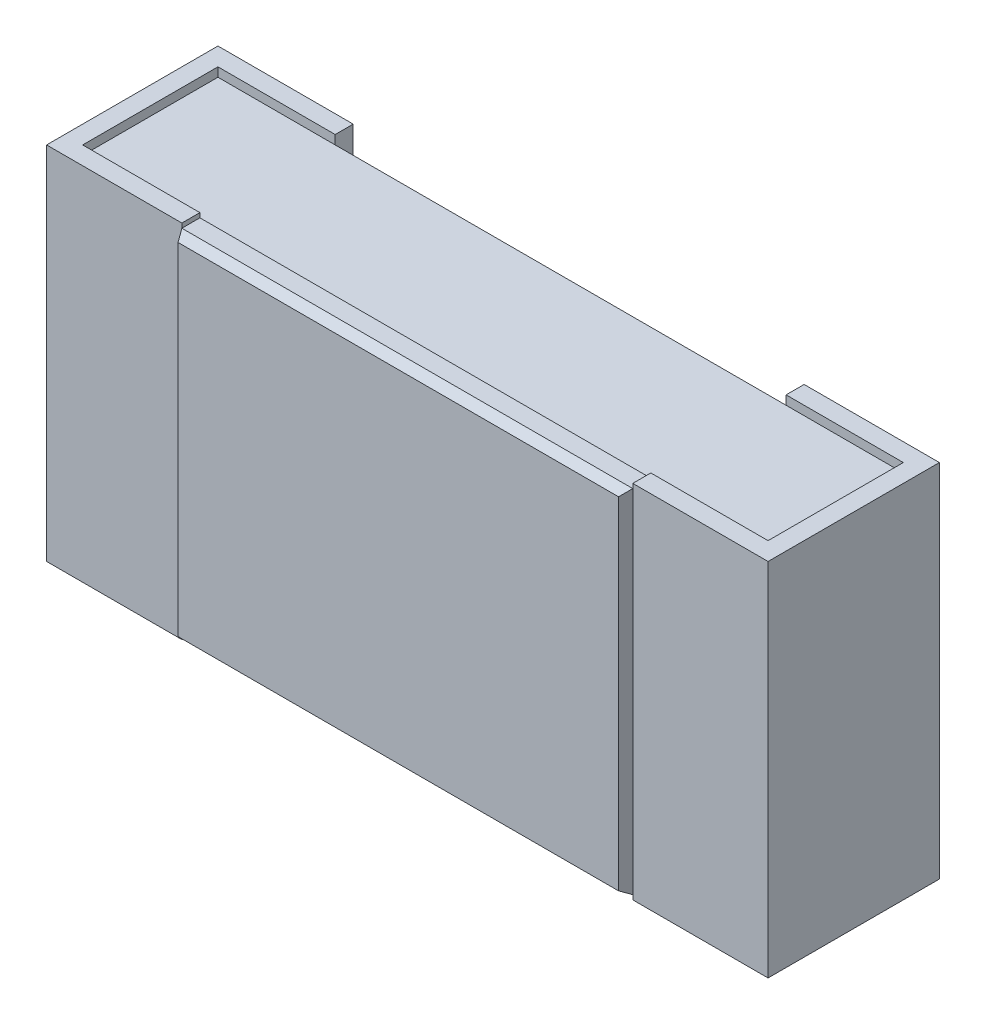
ISO-10303-21;
HEADER;
FILE_DESCRIPTION(('STEP AP214'),'2;1');
FILE_NAME('part.step','',(''),(''),'','','');
FILE_SCHEMA(('AUTOMOTIVE_DESIGN { 1 0 10303 214 1 1 1 1 }'));
ENDSEC;
DATA;
#1=APPLICATION_CONTEXT('core data for automotive mechanical design processes');
#2=APPLICATION_PROTOCOL_DEFINITION('international standard','automotive_design',2000,#1);
#3=PRODUCT_CONTEXT('',#1,'mechanical');
#4=PRODUCT('Part','Part','',(#3));
#5=PRODUCT_RELATED_PRODUCT_CATEGORY('part','',(#4));
#6=PRODUCT_DEFINITION_FORMATION('','',#4);
#7=PRODUCT_DEFINITION_CONTEXT('part definition',#1,'design');
#8=PRODUCT_DEFINITION('design','',#6,#7);
#9=PRODUCT_DEFINITION_SHAPE('','',#8);
#10=(LENGTH_UNIT() NAMED_UNIT(*) SI_UNIT(.MILLI.,.METRE.));
#11=(NAMED_UNIT(*) PLANE_ANGLE_UNIT() SI_UNIT($,.RADIAN.));
#12=(NAMED_UNIT(*) SI_UNIT($,.STERADIAN.) SOLID_ANGLE_UNIT());
#13=UNCERTAINTY_MEASURE_WITH_UNIT(LENGTH_MEASURE(1.E-05),#10,'distance_accuracy_value','');
#14=(GEOMETRIC_REPRESENTATION_CONTEXT(3) GLOBAL_UNCERTAINTY_ASSIGNED_CONTEXT((#13)) GLOBAL_UNIT_ASSIGNED_CONTEXT((#10,
#11,#12)) REPRESENTATION_CONTEXT('',''));
#15=CARTESIAN_POINT('',(0.,0.,0.));
#16=DIRECTION('',(0.,0.,1.));
#17=DIRECTION('',(1.,0.,0.));
#18=AXIS2_PLACEMENT_3D('',#15,#16,#17);
#19=CARTESIAN_POINT('',(0.5,-0.39,0.4));
#20=DIRECTION('',(0.,0.,1.));
#21=DIRECTION('',(1.,0.,0.));
#22=AXIS2_PLACEMENT_3D('',#19,#20,#21);
#23=PLANE('',#22);
#24=DIRECTION('',(0.,1.,0.));
#25=VECTOR('',#24,1.);
#26=CARTESIAN_POINT('',(-0.488452994616151,0.39,0.400000000000087));
#27=LINE('',#26,#25);
#28=CARTESIAN_POINT('',(-0.488452994616038,-0.378452994616038,0.400000000000044));
#29=VERTEX_POINT('',#28);
#30=CARTESIAN_POINT('',(-0.488452994616076,0.378452994616038,0.400000000000066));
#31=VERTEX_POINT('',#30);
#32=EDGE_CURVE('E20',#29,#31,#27,.T.);
#33=ORIENTED_EDGE('',*,*,#32,.F.);
#34=DIRECTION('',(1.,0.,0.));
#35=VECTOR('',#34,1.);
#36=CARTESIAN_POINT('',(-0.5,-0.378452994616151,0.400000000000087));
#37=LINE('',#36,#35);
#38=CARTESIAN_POINT('',(0.488452994616038,-0.378452994616038,0.400000000000044));
#39=VERTEX_POINT('',#38);
#40=EDGE_CURVE('E203',#39,#29,#37,.F.);
#41=ORIENTED_EDGE('',*,*,#40,.F.);
#42=DIRECTION('',(0.,1.,0.));
#43=VECTOR('',#42,1.);
#44=CARTESIAN_POINT('',(0.488452994616151,0.39,0.400000000000087));
#45=LINE('',#44,#43);
#46=CARTESIAN_POINT('',(0.488452994616038,0.378452994616038,0.400000000000044));
#47=VERTEX_POINT('',#46);
#48=EDGE_CURVE('E198',#47,#39,#45,.F.);
#49=ORIENTED_EDGE('',*,*,#48,.F.);
#50=DIRECTION('',(1.,0.,0.));
#51=VECTOR('',#50,1.);
#52=CARTESIAN_POINT('',(-0.5,0.378452994616151,0.400000000000087));
#53=LINE('',#52,#51);
#54=EDGE_CURVE('E213',#31,#47,#53,.T.);
#55=ORIENTED_EDGE('',*,*,#54,.F.);
#56=EDGE_LOOP('',(#33,#41,#49,#55));
#57=FACE_BOUND('',#56,.T.);
#58=ADVANCED_FACE('F17',(#57),#23,.T.);
#59=CARTESIAN_POINT('',(-0.5,0.39,0.38));
#60=DIRECTION('',(-0.866025403784329,0.,0.50000000000019));
#61=DIRECTION('',(0.50000000000019,0.,0.866025403784329));
#62=AXIS2_PLACEMENT_3D('',#59,#60,#61);
#63=PLANE('',#62);
#64=ORIENTED_EDGE('',*,*,#32,.T.);
#65=DIRECTION('',(0.447213595504779,-0.447213595498923,0.774596669239298));
#66=VECTOR('',#65,1.);
#67=CARTESIAN_POINT('',(-0.5,0.39,0.38));
#68=LINE('',#67,#66);
#69=CARTESIAN_POINT('',(-0.5,0.39,0.38));
#70=VERTEX_POINT('',#69);
#71=EDGE_CURVE('E225',#70,#31,#68,.T.);
#72=ORIENTED_EDGE('',*,*,#71,.F.);
#73=DIRECTION('',(0.,1.,0.));
#74=VECTOR('',#73,1.);
#75=CARTESIAN_POINT('',(-0.5,-0.4,0.38));
#76=LINE('',#75,#74);
#77=CARTESIAN_POINT('',(-0.5,-0.39,0.38));
#78=VERTEX_POINT('',#77);
#79=EDGE_CURVE('E219',#78,#70,#76,.T.);
#80=ORIENTED_EDGE('',*,*,#79,.F.);
#81=DIRECTION('',(-0.447213595504779,-0.447213595498923,-0.774596669239298));
#82=VECTOR('',#81,1.);
#83=CARTESIAN_POINT('',(-0.488452994616,-0.378452994616151,0.400000000000087));
#84=LINE('',#83,#82);
#85=EDGE_CURVE('E208',#29,#78,#84,.T.);
#86=ORIENTED_EDGE('',*,*,#85,.F.);
#87=EDGE_LOOP('',(#64,#72,#80,#86));
#88=FACE_BOUND('',#87,.T.);
#89=ADVANCED_FACE('F218',(#88),#63,.T.);
#90=CARTESIAN_POINT('',(-0.5,-0.39,0.38));
#91=DIRECTION('',(0.,-0.866025403784329,0.50000000000019));
#92=DIRECTION('',(0.,-0.50000000000019,-0.866025403784329));
#93=AXIS2_PLACEMENT_3D('',#90,#91,#92);
#94=PLANE('',#93);
#95=ORIENTED_EDGE('',*,*,#40,.T.);
#96=ORIENTED_EDGE('',*,*,#85,.T.);
#97=DIRECTION('',(1.,0.,0.));
#98=VECTOR('',#97,1.);
#99=CARTESIAN_POINT('',(-0.5,-0.39,0.38));
#100=LINE('',#99,#98);
#101=CARTESIAN_POINT('',(0.5,-0.39,0.38));
#102=VERTEX_POINT('',#101);
#103=EDGE_CURVE('E233',#102,#78,#100,.F.);
#104=ORIENTED_EDGE('',*,*,#103,.F.);
#105=DIRECTION('',(0.44721359549892,-0.447213595504782,-0.774596669239297));
#106=VECTOR('',#105,1.);
#107=CARTESIAN_POINT('',(0.488452994616151,-0.378452994616,0.400000000000087));
#108=LINE('',#107,#106);
#109=EDGE_CURVE('E210',#39,#102,#108,.T.);
#110=ORIENTED_EDGE('',*,*,#109,.F.);
#111=EDGE_LOOP('',(#95,#96,#104,#110));
#112=FACE_BOUND('',#111,.T.);
#113=ADVANCED_FACE('F205',(#112),#94,.T.);
#114=CARTESIAN_POINT('',(0.5,0.39,0.38));
#115=DIRECTION('',(0.866025403784329,0.,0.50000000000019));
#116=DIRECTION('',(0.50000000000019,0.,-0.866025403784329));
#117=AXIS2_PLACEMENT_3D('',#114,#115,#116);
#118=PLANE('',#117);
#119=ORIENTED_EDGE('',*,*,#48,.T.);
#120=ORIENTED_EDGE('',*,*,#109,.T.);
#121=DIRECTION('',(0.,1.,0.));
#122=VECTOR('',#121,1.);
#123=CARTESIAN_POINT('',(0.5,-0.4,0.38));
#124=LINE('',#123,#122);
#125=CARTESIAN_POINT('',(0.5,0.39,0.38));
#126=VERTEX_POINT('',#125);
#127=EDGE_CURVE('E244',#126,#102,#124,.F.);
#128=ORIENTED_EDGE('',*,*,#127,.F.);
#129=DIRECTION('',(0.447213595504775,0.447213595498924,-0.774596669239299));
#130=VECTOR('',#129,1.);
#131=CARTESIAN_POINT('',(0.488452994616,0.378452994616151,0.400000000000087));
#132=LINE('',#131,#130);
#133=EDGE_CURVE('E228',#47,#126,#132,.T.);
#134=ORIENTED_EDGE('',*,*,#133,.F.);
#135=EDGE_LOOP('',(#119,#120,#128,#134));
#136=FACE_BOUND('',#135,.T.);
#137=ADVANCED_FACE('F581',(#136),#118,.T.);
#138=CARTESIAN_POINT('',(-0.5,0.39,0.38));
#139=DIRECTION('',(0.,0.866025403784329,0.50000000000019));
#140=DIRECTION('',(0.,-0.50000000000019,0.866025403784329));
#141=AXIS2_PLACEMENT_3D('',#138,#139,#140);
#142=PLANE('',#141);
#143=ORIENTED_EDGE('',*,*,#54,.T.);
#144=ORIENTED_EDGE('',*,*,#133,.T.);
#145=DIRECTION('',(1.,0.,0.));
#146=VECTOR('',#145,1.);
#147=CARTESIAN_POINT('',(-0.5,0.39,0.38));
#148=LINE('',#147,#146);
#149=EDGE_CURVE('E252',#70,#126,#148,.T.);
#150=ORIENTED_EDGE('',*,*,#149,.F.);
#151=ORIENTED_EDGE('',*,*,#71,.T.);
#152=EDGE_LOOP('',(#143,#144,#150,#151));
#153=FACE_BOUND('',#152,.T.);
#154=ADVANCED_FACE('F577',(#153),#142,.T.);
#155=CARTESIAN_POINT('',(-0.8,-0.4,0.38));
#156=DIRECTION('',(0.,0.,1.));
#157=DIRECTION('',(1.,0.,0.));
#158=AXIS2_PLACEMENT_3D('',#155,#156,#157);
#159=PLANE('',#158);
#160=DIRECTION('',(0.,1.,0.));
#161=VECTOR('',#160,1.);
#162=CARTESIAN_POINT('',(-0.8,-0.4,0.38));
#163=LINE('',#162,#161);
#164=CARTESIAN_POINT('',(-0.8,-0.4,0.38));
#165=VERTEX_POINT('',#164);
#166=CARTESIAN_POINT('',(-0.8,0.4,0.38));
#167=VERTEX_POINT('',#166);
#168=EDGE_CURVE('E231',#165,#167,#163,.T.);
#169=ORIENTED_EDGE('',*,*,#168,.F.);
#170=DIRECTION('',(1.,0.,0.));
#171=VECTOR('',#170,1.);
#172=CARTESIAN_POINT('',(-0.8,-0.4,0.38));
#173=LINE('',#172,#171);
#174=CARTESIAN_POINT('',(-0.5,-0.4,0.38));
#175=VERTEX_POINT('',#174);
#176=EDGE_CURVE('E275',#165,#175,#173,.T.);
#177=ORIENTED_EDGE('',*,*,#176,.T.);
#178=DIRECTION('',(0.,1.,0.));
#179=VECTOR('',#178,1.);
#180=CARTESIAN_POINT('',(-0.5,-0.4,0.38));
#181=LINE('',#180,#179);
#182=EDGE_CURVE('E238',#78,#175,#181,.F.);
#183=ORIENTED_EDGE('',*,*,#182,.F.);
#184=ORIENTED_EDGE('',*,*,#79,.T.);
#185=DIRECTION('',(0.,1.,0.));
#186=VECTOR('',#185,1.);
#187=CARTESIAN_POINT('',(-0.5,-0.4,0.38));
#188=LINE('',#187,#186);
#189=CARTESIAN_POINT('',(-0.5,0.4,0.38));
#190=VERTEX_POINT('',#189);
#191=EDGE_CURVE('E249',#190,#70,#188,.F.);
#192=ORIENTED_EDGE('',*,*,#191,.F.);
#193=DIRECTION('',(1.,0.,0.));
#194=VECTOR('',#193,1.);
#195=CARTESIAN_POINT('',(-0.8,0.4,0.38));
#196=LINE('',#195,#194);
#197=EDGE_CURVE('E268',#167,#190,#196,.T.);
#198=ORIENTED_EDGE('',*,*,#197,.F.);
#199=EDGE_LOOP('',(#169,#177,#183,#184,#192,#198));
#200=FACE_BOUND('',#199,.T.);
#201=ADVANCED_FACE('F573',(#200),#159,.T.);
#202=CARTESIAN_POINT('',(-0.8,-0.4,0.));
#203=DIRECTION('',(-1.,0.,0.));
#204=DIRECTION('',(0.,0.,1.));
#205=AXIS2_PLACEMENT_3D('',#202,#203,#204);
#206=PLANE('',#205);
#207=DIRECTION('',(0.,1.,0.));
#208=VECTOR('',#207,1.);
#209=CARTESIAN_POINT('',(-0.8,-0.4,0.));
#210=LINE('',#209,#208);
#211=CARTESIAN_POINT('',(-0.8,-0.4,0.));
#212=VERTEX_POINT('',#211);
#213=CARTESIAN_POINT('',(-0.8,0.4,0.));
#214=VERTEX_POINT('',#213);
#215=EDGE_CURVE('E263',#212,#214,#210,.T.);
#216=ORIENTED_EDGE('',*,*,#215,.F.);
#217=DIRECTION('',(0.,0.,1.));
#218=VECTOR('',#217,1.);
#219=CARTESIAN_POINT('',(-0.8,-0.4,0.38));
#220=LINE('',#219,#218);
#221=EDGE_CURVE('E284',#212,#165,#220,.T.);
#222=ORIENTED_EDGE('',*,*,#221,.T.);
#223=ORIENTED_EDGE('',*,*,#168,.T.);
#224=DIRECTION('',(0.,0.,1.));
#225=VECTOR('',#224,1.);
#226=CARTESIAN_POINT('',(-0.8,0.4,0.38));
#227=LINE('',#226,#225);
#228=EDGE_CURVE('E265',#214,#167,#227,.T.);
#229=ORIENTED_EDGE('',*,*,#228,.F.);
#230=EDGE_LOOP('',(#216,#222,#223,#229));
#231=FACE_BOUND('',#230,.T.);
#232=ADVANCED_FACE('F569',(#231),#206,.T.);
#233=CARTESIAN_POINT('',(-0.5,-0.39,0.34));
#234=DIRECTION('',(0.,-1.,0.));
#235=DIRECTION('',(0.,0.,-1.));
#236=AXIS2_PLACEMENT_3D('',#233,#234,#235);
#237=PLANE('',#236);
#238=DIRECTION('',(-1.,0.,0.));
#239=VECTOR('',#238,1.);
#240=CARTESIAN_POINT('',(-0.5,-0.39,0.34));
#241=LINE('',#240,#239);
#242=CARTESIAN_POINT('',(0.5,-0.39,0.34));
#243=VERTEX_POINT('',#242);
#244=CARTESIAN_POINT('',(-0.5,-0.39,0.34));
#245=VERTEX_POINT('',#244);
#246=EDGE_CURVE('E292',#243,#245,#241,.T.);
#247=ORIENTED_EDGE('',*,*,#246,.F.);
#248=DIRECTION('',(0.,0.,1.));
#249=VECTOR('',#248,1.);
#250=CARTESIAN_POINT('',(0.5,-0.39,0.38));
#251=LINE('',#250,#249);
#252=EDGE_CURVE('E240',#102,#243,#251,.F.);
#253=ORIENTED_EDGE('',*,*,#252,.F.);
#254=ORIENTED_EDGE('',*,*,#103,.T.);
#255=DIRECTION('',(0.,0.,-1.));
#256=VECTOR('',#255,1.);
#257=CARTESIAN_POINT('',(-0.5,-0.39,0.38));
#258=LINE('',#257,#256);
#259=EDGE_CURVE('E235',#245,#78,#258,.F.);
#260=ORIENTED_EDGE('',*,*,#259,.F.);
#261=EDGE_LOOP('',(#247,#253,#254,#260));
#262=FACE_BOUND('',#261,.T.);
#263=ADVANCED_FACE('F565',(#262),#237,.T.);
#264=CARTESIAN_POINT('',(-0.5,-0.4,0.38));
#265=DIRECTION('',(1.,0.,0.));
#266=DIRECTION('',(0.,0.,-1.));
#267=AXIS2_PLACEMENT_3D('',#264,#265,#266);
#268=PLANE('',#267);
#269=DIRECTION('',(0.,0.,1.));
#270=VECTOR('',#269,1.);
#271=CARTESIAN_POINT('',(-0.5,-0.4,0.38));
#272=LINE('',#271,#270);
#273=CARTESIAN_POINT('',(-0.5,-0.4,0.34));
#274=VERTEX_POINT('',#273);
#275=EDGE_CURVE('E278',#175,#274,#272,.F.);
#276=ORIENTED_EDGE('',*,*,#275,.T.);
#277=DIRECTION('',(0.,1.,0.));
#278=VECTOR('',#277,1.);
#279=CARTESIAN_POINT('',(-0.5,-0.4,0.34));
#280=LINE('',#279,#278);
#281=EDGE_CURVE('E294',#245,#274,#280,.F.);
#282=ORIENTED_EDGE('',*,*,#281,.F.);
#283=ORIENTED_EDGE('',*,*,#259,.T.);
#284=ORIENTED_EDGE('',*,*,#182,.T.);
#285=EDGE_LOOP('',(#276,#282,#283,#284));
#286=FACE_BOUND('',#285,.T.);
#287=ADVANCED_FACE('F561',(#286),#268,.T.);
#288=CARTESIAN_POINT('',(0.5,-0.4,0.38));
#289=DIRECTION('',(-1.,0.,0.));
#290=DIRECTION('',(0.,0.,1.));
#291=AXIS2_PLACEMENT_3D('',#288,#289,#290);
#292=PLANE('',#291);
#293=DIRECTION('',(0.,0.,-1.));
#294=VECTOR('',#293,1.);
#295=CARTESIAN_POINT('',(0.5,-0.4,0.34));
#296=LINE('',#295,#294);
#297=CARTESIAN_POINT('',(0.5,-0.4,0.38));
#298=VERTEX_POINT('',#297);
#299=CARTESIAN_POINT('',(0.5,-0.4,0.34));
#300=VERTEX_POINT('',#299);
#301=EDGE_CURVE('E323',#298,#300,#296,.T.);
#302=ORIENTED_EDGE('',*,*,#301,.F.);
#303=DIRECTION('',(0.,1.,0.));
#304=VECTOR('',#303,1.);
#305=CARTESIAN_POINT('',(0.5,-0.4,0.38));
#306=LINE('',#305,#304);
#307=EDGE_CURVE('E247',#102,#298,#306,.F.);
#308=ORIENTED_EDGE('',*,*,#307,.F.);
#309=ORIENTED_EDGE('',*,*,#252,.T.);
#310=DIRECTION('',(0.,1.,0.));
#311=VECTOR('',#310,1.);
#312=CARTESIAN_POINT('',(0.5,-0.4,0.339999999999999));
#313=LINE('',#312,#311);
#314=EDGE_CURVE('E289',#300,#243,#313,.T.);
#315=ORIENTED_EDGE('',*,*,#314,.F.);
#316=EDGE_LOOP('',(#302,#308,#309,#315));
#317=FACE_BOUND('',#316,.T.);
#318=ADVANCED_FACE('F557',(#317),#292,.T.);
#319=CARTESIAN_POINT('',(0.8,-0.4,0.));
#320=DIRECTION('',(1.,0.,0.));
#321=DIRECTION('',(0.,0.,-1.));
#322=AXIS2_PLACEMENT_3D('',#319,#320,#321);
#323=PLANE('',#322);
#324=DIRECTION('',(0.,1.,0.));
#325=VECTOR('',#324,1.);
#326=CARTESIAN_POINT('',(0.8,-0.4,0.38));
#327=LINE('',#326,#325);
#328=CARTESIAN_POINT('',(0.8,-0.4,0.38));
#329=VERTEX_POINT('',#328);
#330=CARTESIAN_POINT('',(0.8,0.4,0.38));
#331=VERTEX_POINT('',#330);
#332=EDGE_CURVE('E242',#329,#331,#327,.T.);
#333=ORIENTED_EDGE('',*,*,#332,.F.);
#334=DIRECTION('',(0.,0.,-1.));
#335=VECTOR('',#334,1.);
#336=CARTESIAN_POINT('',(0.8,-0.4,0.34));
#337=LINE('',#336,#335);
#338=CARTESIAN_POINT('',(0.8,-0.4,0.));
#339=VERTEX_POINT('',#338);
#340=EDGE_CURVE('E334',#339,#329,#337,.F.);
#341=ORIENTED_EDGE('',*,*,#340,.F.);
#342=DIRECTION('',(0.,1.,0.));
#343=VECTOR('',#342,1.);
#344=CARTESIAN_POINT('',(0.8,-0.4,0.));
#345=LINE('',#344,#343);
#346=CARTESIAN_POINT('',(0.8,0.4,0.));
#347=VERTEX_POINT('',#346);
#348=EDGE_CURVE('E321',#347,#339,#345,.F.);
#349=ORIENTED_EDGE('',*,*,#348,.F.);
#350=DIRECTION('',(0.,0.,-1.));
#351=VECTOR('',#350,1.);
#352=CARTESIAN_POINT('',(0.8,0.4,0.34));
#353=LINE('',#352,#351);
#354=EDGE_CURVE('E309',#347,#331,#353,.F.);
#355=ORIENTED_EDGE('',*,*,#354,.T.);
#356=EDGE_LOOP('',(#333,#341,#349,#355));
#357=FACE_BOUND('',#356,.T.);
#358=ADVANCED_FACE('F553',(#357),#323,.T.);
#359=CARTESIAN_POINT('',(0.8,-0.4,0.38));
#360=DIRECTION('',(0.,0.,1.));
#361=DIRECTION('',(1.,0.,0.));
#362=AXIS2_PLACEMENT_3D('',#359,#360,#361);
#363=PLANE('',#362);
#364=ORIENTED_EDGE('',*,*,#307,.T.);
#365=DIRECTION('',(1.,0.,0.));
#366=VECTOR('',#365,1.);
#367=CARTESIAN_POINT('',(0.5,-0.4,0.38));
#368=LINE('',#367,#366);
#369=EDGE_CURVE('E336',#329,#298,#368,.F.);
#370=ORIENTED_EDGE('',*,*,#369,.F.);
#371=ORIENTED_EDGE('',*,*,#332,.T.);
#372=DIRECTION('',(1.,0.,0.));
#373=VECTOR('',#372,1.);
#374=CARTESIAN_POINT('',(0.5,0.4,0.38));
#375=LINE('',#374,#373);
#376=CARTESIAN_POINT('',(0.5,0.4,0.38));
#377=VERTEX_POINT('',#376);
#378=EDGE_CURVE('E312',#331,#377,#375,.F.);
#379=ORIENTED_EDGE('',*,*,#378,.T.);
#380=DIRECTION('',(0.,1.,0.));
#381=VECTOR('',#380,1.);
#382=CARTESIAN_POINT('',(0.5,-0.4,0.38));
#383=LINE('',#382,#381);
#384=EDGE_CURVE('E261',#126,#377,#383,.T.);
#385=ORIENTED_EDGE('',*,*,#384,.F.);
#386=ORIENTED_EDGE('',*,*,#127,.T.);
#387=EDGE_LOOP('',(#364,#370,#371,#379,#385,#386));
#388=FACE_BOUND('',#387,.T.);
#389=ADVANCED_FACE('F549',(#388),#363,.T.);
#390=CARTESIAN_POINT('',(-0.5,-0.4,0.38));
#391=DIRECTION('',(1.,0.,0.));
#392=DIRECTION('',(0.,0.,-1.));
#393=AXIS2_PLACEMENT_3D('',#390,#391,#392);
#394=PLANE('',#393);
#395=DIRECTION('',(0.,0.,1.));
#396=VECTOR('',#395,1.);
#397=CARTESIAN_POINT('',(-0.5,0.4,0.38));
#398=LINE('',#397,#396);
#399=CARTESIAN_POINT('',(-0.5,0.4,0.34));
#400=VERTEX_POINT('',#399);
#401=EDGE_CURVE('E270',#190,#400,#398,.F.);
#402=ORIENTED_EDGE('',*,*,#401,.F.);
#403=ORIENTED_EDGE('',*,*,#191,.T.);
#404=DIRECTION('',(0.,0.,1.));
#405=VECTOR('',#404,1.);
#406=CARTESIAN_POINT('',(-0.5,0.39,0.34));
#407=LINE('',#406,#405);
#408=CARTESIAN_POINT('',(-0.5,0.39,0.34));
#409=VERTEX_POINT('',#408);
#410=EDGE_CURVE('E255',#409,#70,#407,.T.);
#411=ORIENTED_EDGE('',*,*,#410,.F.);
#412=DIRECTION('',(0.,1.,0.));
#413=VECTOR('',#412,1.);
#414=CARTESIAN_POINT('',(-0.5,-0.4,0.34));
#415=LINE('',#414,#413);
#416=EDGE_CURVE('E344',#400,#409,#415,.F.);
#417=ORIENTED_EDGE('',*,*,#416,.F.);
#418=EDGE_LOOP('',(#402,#403,#411,#417));
#419=FACE_BOUND('',#418,.T.);
#420=ADVANCED_FACE('F545',(#419),#394,.T.);
#421=CARTESIAN_POINT('',(-0.5,0.39,0.34));
#422=DIRECTION('',(0.,1.,0.));
#423=DIRECTION('',(0.,0.,1.));
#424=AXIS2_PLACEMENT_3D('',#421,#422,#423);
#425=PLANE('',#424);
#426=DIRECTION('',(-1.,0.,0.));
#427=VECTOR('',#426,1.);
#428=CARTESIAN_POINT('',(-0.5,0.39,0.34));
#429=LINE('',#428,#427);
#430=CARTESIAN_POINT('',(0.5,0.39,0.34));
#431=VERTEX_POINT('',#430);
#432=EDGE_CURVE('E346',#409,#431,#429,.F.);
#433=ORIENTED_EDGE('',*,*,#432,.F.);
#434=ORIENTED_EDGE('',*,*,#410,.T.);
#435=ORIENTED_EDGE('',*,*,#149,.T.);
#436=DIRECTION('',(0.,0.,1.));
#437=VECTOR('',#436,1.);
#438=CARTESIAN_POINT('',(0.5,0.39,0.38));
#439=LINE('',#438,#437);
#440=EDGE_CURVE('E258',#431,#126,#439,.T.);
#441=ORIENTED_EDGE('',*,*,#440,.F.);
#442=EDGE_LOOP('',(#433,#434,#435,#441));
#443=FACE_BOUND('',#442,.T.);
#444=ADVANCED_FACE('F541',(#443),#425,.T.);
#445=CARTESIAN_POINT('',(0.5,-0.4,0.38));
#446=DIRECTION('',(-1.,0.,0.));
#447=DIRECTION('',(0.,0.,1.));
#448=AXIS2_PLACEMENT_3D('',#445,#446,#447);
#449=PLANE('',#448);
#450=DIRECTION('',(0.,0.,-1.));
#451=VECTOR('',#450,1.);
#452=CARTESIAN_POINT('',(0.5,0.4,0.34));
#453=LINE('',#452,#451);
#454=CARTESIAN_POINT('',(0.5,0.4,0.34));
#455=VERTEX_POINT('',#454);
#456=EDGE_CURVE('E315',#377,#455,#453,.T.);
#457=ORIENTED_EDGE('',*,*,#456,.T.);
#458=DIRECTION('',(0.,1.,0.));
#459=VECTOR('',#458,1.);
#460=CARTESIAN_POINT('',(0.5,-0.4,0.339999999999999));
#461=LINE('',#460,#459);
#462=EDGE_CURVE('E348',#431,#455,#461,.T.);
#463=ORIENTED_EDGE('',*,*,#462,.F.);
#464=ORIENTED_EDGE('',*,*,#440,.T.);
#465=ORIENTED_EDGE('',*,*,#384,.T.);
#466=EDGE_LOOP('',(#457,#463,#464,#465));
#467=FACE_BOUND('',#466,.T.);
#468=ADVANCED_FACE('F538',(#467),#449,.T.);
#469=CARTESIAN_POINT('',(-0.8,-0.4,0.));
#470=DIRECTION('',(0.,0.,-1.));
#471=DIRECTION('',(-1.,0.,0.));
#472=AXIS2_PLACEMENT_3D('',#469,#470,#471);
#473=PLANE('',#472);
#474=DIRECTION('',(0.,1.,0.));
#475=VECTOR('',#474,1.);
#476=CARTESIAN_POINT('',(-0.5,-0.4,0.));
#477=LINE('',#476,#475);
#478=CARTESIAN_POINT('',(-0.5,-0.4,0.));
#479=VERTEX_POINT('',#478);
#480=CARTESIAN_POINT('',(-0.5,0.4,0.));
#481=VERTEX_POINT('',#480);
#482=EDGE_CURVE('E367',#479,#481,#477,.T.);
#483=ORIENTED_EDGE('',*,*,#482,.F.);
#484=DIRECTION('',(1.,0.,0.));
#485=VECTOR('',#484,1.);
#486=CARTESIAN_POINT('',(-0.8,-0.4,0.));
#487=LINE('',#486,#485);
#488=EDGE_CURVE('E281',#479,#212,#487,.F.);
#489=ORIENTED_EDGE('',*,*,#488,.T.);
#490=ORIENTED_EDGE('',*,*,#215,.T.);
#491=DIRECTION('',(1.,0.,0.));
#492=VECTOR('',#491,1.);
#493=CARTESIAN_POINT('',(-0.8,0.4,0.));
#494=LINE('',#493,#492);
#495=EDGE_CURVE('E272',#481,#214,#494,.F.);
#496=ORIENTED_EDGE('',*,*,#495,.F.);
#497=EDGE_LOOP('',(#483,#489,#490,#496));
#498=FACE_BOUND('',#497,.T.);
#499=ADVANCED_FACE('F455',(#498),#473,.T.);
#500=CARTESIAN_POINT('',(-0.8,0.4,0.38));
#501=DIRECTION('',(0.,1.,0.));
#502=DIRECTION('',(0.,0.,1.));
#503=AXIS2_PLACEMENT_3D('',#500,#501,#502);
#504=PLANE('',#503);
#505=DIRECTION('',(0.,0.,-1.));
#506=VECTOR('',#505,1.);
#507=CARTESIAN_POINT('',(-0.5,0.4,0.));
#508=LINE('',#507,#506);
#509=CARTESIAN_POINT('',(-0.5,0.4,0.04));
#510=VERTEX_POINT('',#509);
#511=EDGE_CURVE('E369',#481,#510,#508,.F.);
#512=ORIENTED_EDGE('',*,*,#511,.F.);
#513=ORIENTED_EDGE('',*,*,#495,.T.);
#514=ORIENTED_EDGE('',*,*,#228,.T.);
#515=ORIENTED_EDGE('',*,*,#197,.T.);
#516=ORIENTED_EDGE('',*,*,#401,.T.);
#517=DIRECTION('',(-1.,0.,0.));
#518=VECTOR('',#517,1.);
#519=CARTESIAN_POINT('',(-0.5,0.4,0.34));
#520=LINE('',#519,#518);
#521=CARTESIAN_POINT('',(-0.76,0.4,0.34));
#522=VERTEX_POINT('',#521);
#523=EDGE_CURVE('E341',#522,#400,#520,.F.);
#524=ORIENTED_EDGE('',*,*,#523,.F.);
#525=DIRECTION('',(0.,0.,-1.));
#526=VECTOR('',#525,1.);
#527=CARTESIAN_POINT('',(-0.76,0.4,0.04));
#528=LINE('',#527,#526);
#529=CARTESIAN_POINT('',(-0.76,0.4,0.04));
#530=VERTEX_POINT('',#529);
#531=EDGE_CURVE('E354',#530,#522,#528,.F.);
#532=ORIENTED_EDGE('',*,*,#531,.F.);
#533=DIRECTION('',(1.,0.,0.));
#534=VECTOR('',#533,1.);
#535=CARTESIAN_POINT('',(-0.76,0.4,0.04));
#536=LINE('',#535,#534);
#537=EDGE_CURVE('E358',#510,#530,#536,.F.);
#538=ORIENTED_EDGE('',*,*,#537,.F.);
#539=EDGE_LOOP('',(#512,#513,#514,#515,#516,#524,#532,#538));
#540=FACE_BOUND('',#539,.T.);
#541=ADVANCED_FACE('F462',(#540),#504,.T.);
#542=CARTESIAN_POINT('',(-0.8,-0.4,0.38));
#543=DIRECTION('',(0.,1.,0.));
#544=DIRECTION('',(0.,0.,1.));
#545=AXIS2_PLACEMENT_3D('',#542,#543,#544);
#546=PLANE('',#545);
#547=ORIENTED_EDGE('',*,*,#488,.F.);
#548=DIRECTION('',(0.,0.,-1.));
#549=VECTOR('',#548,1.);
#550=CARTESIAN_POINT('',(-0.5,-0.4,0.));
#551=LINE('',#550,#549);
#552=CARTESIAN_POINT('',(-0.5,-0.4,0.04));
#553=VERTEX_POINT('',#552);
#554=EDGE_CURVE('E376',#553,#479,#551,.T.);
#555=ORIENTED_EDGE('',*,*,#554,.F.);
#556=DIRECTION('',(1.,0.,0.));
#557=VECTOR('',#556,1.);
#558=CARTESIAN_POINT('',(-0.76,-0.4,0.04));
#559=LINE('',#558,#557);
#560=CARTESIAN_POINT('',(-0.76,-0.4,0.04));
#561=VERTEX_POINT('',#560);
#562=EDGE_CURVE('E305',#561,#553,#559,.T.);
#563=ORIENTED_EDGE('',*,*,#562,.F.);
#564=DIRECTION('',(0.,0.,-1.));
#565=VECTOR('',#564,1.);
#566=CARTESIAN_POINT('',(-0.76,-0.4,0.04));
#567=LINE('',#566,#565);
#568=CARTESIAN_POINT('',(-0.76,-0.4,0.34));
#569=VERTEX_POINT('',#568);
#570=EDGE_CURVE('E287',#569,#561,#567,.T.);
#571=ORIENTED_EDGE('',*,*,#570,.F.);
#572=DIRECTION('',(-1.,0.,0.));
#573=VECTOR('',#572,1.);
#574=CARTESIAN_POINT('',(-0.5,-0.4,0.34));
#575=LINE('',#574,#573);
#576=EDGE_CURVE('E296',#274,#569,#575,.T.);
#577=ORIENTED_EDGE('',*,*,#576,.F.);
#578=ORIENTED_EDGE('',*,*,#275,.F.);
#579=ORIENTED_EDGE('',*,*,#176,.F.);
#580=ORIENTED_EDGE('',*,*,#221,.F.);
#581=EDGE_LOOP('',(#547,#555,#563,#571,#577,#578,#579,#580));
#582=FACE_BOUND('',#581,.T.);
#583=ADVANCED_FACE('F451',(#582),#546,.F.);
#584=CARTESIAN_POINT('',(-0.76,-0.4,0.04));
#585=DIRECTION('',(1.,0.,0.));
#586=DIRECTION('',(0.,0.,-1.));
#587=AXIS2_PLACEMENT_3D('',#584,#585,#586);
#588=PLANE('',#587);
#589=ORIENTED_EDGE('',*,*,#570,.T.);
#590=DIRECTION('',(0.,1.,0.));
#591=VECTOR('',#590,1.);
#592=CARTESIAN_POINT('',(-0.76,-0.4,0.04));
#593=LINE('',#592,#591);
#594=CARTESIAN_POINT('',(-0.76,-0.38,0.04));
#595=VERTEX_POINT('',#594);
#596=EDGE_CURVE('E302',#595,#561,#593,.F.);
#597=ORIENTED_EDGE('',*,*,#596,.F.);
#598=DIRECTION('',(0.,0.,1.));
#599=VECTOR('',#598,1.);
#600=CARTESIAN_POINT('',(-0.76,-0.38,0.34));
#601=LINE('',#600,#599);
#602=CARTESIAN_POINT('',(-0.76,-0.38,0.34));
#603=VERTEX_POINT('',#602);
#604=EDGE_CURVE('E379',#595,#603,#601,.T.);
#605=ORIENTED_EDGE('',*,*,#604,.T.);
#606=DIRECTION('',(0.,1.,0.));
#607=VECTOR('',#606,1.);
#608=CARTESIAN_POINT('',(-0.76,-0.4,0.34));
#609=LINE('',#608,#607);
#610=EDGE_CURVE('E298',#569,#603,#609,.T.);
#611=ORIENTED_EDGE('',*,*,#610,.F.);
#612=EDGE_LOOP('',(#589,#597,#605,#611));
#613=FACE_BOUND('',#612,.T.);
#614=ADVANCED_FACE('F527',(#613),#588,.T.);
#615=CARTESIAN_POINT('',(-0.5,-0.4,0.34));
#616=DIRECTION('',(0.,0.,-1.));
#617=DIRECTION('',(-1.,0.,0.));
#618=AXIS2_PLACEMENT_3D('',#615,#616,#617);
#619=PLANE('',#618);
#620=ORIENTED_EDGE('',*,*,#576,.T.);
#621=ORIENTED_EDGE('',*,*,#610,.T.);
#622=DIRECTION('',(1.,0.,0.));
#623=VECTOR('',#622,1.);
#624=CARTESIAN_POINT('',(-0.76,-0.38,0.34));
#625=LINE('',#624,#623);
#626=CARTESIAN_POINT('',(0.76,-0.38,0.34));
#627=VERTEX_POINT('',#626);
#628=EDGE_CURVE('E382',#603,#627,#625,.T.);
#629=ORIENTED_EDGE('',*,*,#628,.T.);
#630=DIRECTION('',(0.,1.,0.));
#631=VECTOR('',#630,1.);
#632=CARTESIAN_POINT('',(0.76,-0.4,0.34));
#633=LINE('',#632,#631);
#634=CARTESIAN_POINT('',(0.76,-0.4,0.34));
#635=VERTEX_POINT('',#634);
#636=EDGE_CURVE('E300',#635,#627,#633,.T.);
#637=ORIENTED_EDGE('',*,*,#636,.F.);
#638=DIRECTION('',(1.,0.,0.));
#639=VECTOR('',#638,1.);
#640=CARTESIAN_POINT('',(0.5,-0.4,0.34));
#641=LINE('',#640,#639);
#642=EDGE_CURVE('E325',#300,#635,#641,.T.);
#643=ORIENTED_EDGE('',*,*,#642,.F.);
#644=ORIENTED_EDGE('',*,*,#314,.T.);
#645=ORIENTED_EDGE('',*,*,#246,.T.);
#646=ORIENTED_EDGE('',*,*,#281,.T.);
#647=EDGE_LOOP('',(#620,#621,#629,#637,#643,#644,#645,#646));
#648=FACE_BOUND('',#647,.T.);
#649=ADVANCED_FACE('F523',(#648),#619,.T.);
#650=CARTESIAN_POINT('',(0.76,-0.4,0.04));
#651=DIRECTION('',(-1.,0.,0.));
#652=DIRECTION('',(0.,0.,1.));
#653=AXIS2_PLACEMENT_3D('',#650,#651,#652);
#654=PLANE('',#653);
#655=DIRECTION('',(0.,0.,-1.));
#656=VECTOR('',#655,1.);
#657=CARTESIAN_POINT('',(0.76,-0.4,0.34));
#658=LINE('',#657,#656);
#659=CARTESIAN_POINT('',(0.76,-0.4,0.04));
#660=VERTEX_POINT('',#659);
#661=EDGE_CURVE('E327',#635,#660,#658,.T.);
#662=ORIENTED_EDGE('',*,*,#661,.F.);
#663=ORIENTED_EDGE('',*,*,#636,.T.);
#664=DIRECTION('',(0.,0.,1.));
#665=VECTOR('',#664,1.);
#666=CARTESIAN_POINT('',(0.76,-0.38,0.34));
#667=LINE('',#666,#665);
#668=CARTESIAN_POINT('',(0.76,-0.38,0.04));
#669=VERTEX_POINT('',#668);
#670=EDGE_CURVE('E385',#627,#669,#667,.F.);
#671=ORIENTED_EDGE('',*,*,#670,.T.);
#672=DIRECTION('',(0.,1.,0.));
#673=VECTOR('',#672,1.);
#674=CARTESIAN_POINT('',(0.76,-0.4,0.04));
#675=LINE('',#674,#673);
#676=EDGE_CURVE('E307',#660,#669,#675,.T.);
#677=ORIENTED_EDGE('',*,*,#676,.F.);
#678=EDGE_LOOP('',(#662,#663,#671,#677));
#679=FACE_BOUND('',#678,.T.);
#680=ADVANCED_FACE('F520',(#679),#654,.T.);
#681=CARTESIAN_POINT('',(-0.76,-0.4,0.04));
#682=DIRECTION('',(0.,0.,1.));
#683=DIRECTION('',(1.,0.,0.));
#684=AXIS2_PLACEMENT_3D('',#681,#682,#683);
#685=PLANE('',#684);
#686=ORIENTED_EDGE('',*,*,#562,.T.);
#687=DIRECTION('',(0.,1.,0.));
#688=VECTOR('',#687,1.);
#689=CARTESIAN_POINT('',(-0.5,-0.4,0.04));
#690=LINE('',#689,#688);
#691=CARTESIAN_POINT('',(-0.5,-0.38,0.04));
#692=VERTEX_POINT('',#691);
#693=EDGE_CURVE('E373',#692,#553,#690,.F.);
#694=ORIENTED_EDGE('',*,*,#693,.F.);
#695=DIRECTION('',(1.,0.,0.));
#696=VECTOR('',#695,1.);
#697=CARTESIAN_POINT('',(-0.76,-0.38,0.04));
#698=LINE('',#697,#696);
#699=EDGE_CURVE('E391',#692,#595,#698,.F.);
#700=ORIENTED_EDGE('',*,*,#699,.T.);
#701=ORIENTED_EDGE('',*,*,#596,.T.);
#702=EDGE_LOOP('',(#686,#694,#700,#701));
#703=FACE_BOUND('',#702,.T.);
#704=ADVANCED_FACE('F444',(#703),#685,.T.);
#705=CARTESIAN_POINT('',(0.76,-0.4,0.04));
#706=DIRECTION('',(0.,0.,1.));
#707=DIRECTION('',(1.,0.,0.));
#708=AXIS2_PLACEMENT_3D('',#705,#706,#707);
#709=PLANE('',#708);
#710=DIRECTION('',(1.,0.,0.));
#711=VECTOR('',#710,1.);
#712=CARTESIAN_POINT('',(0.5,-0.4,0.04));
#713=LINE('',#712,#711);
#714=CARTESIAN_POINT('',(0.5,-0.4,0.04));
#715=VERTEX_POINT('',#714);
#716=EDGE_CURVE('E329',#660,#715,#713,.F.);
#717=ORIENTED_EDGE('',*,*,#716,.F.);
#718=ORIENTED_EDGE('',*,*,#676,.T.);
#719=DIRECTION('',(1.,0.,0.));
#720=VECTOR('',#719,1.);
#721=CARTESIAN_POINT('',(-0.76,-0.38,0.04));
#722=LINE('',#721,#720);
#723=CARTESIAN_POINT('',(0.5,-0.38,0.04));
#724=VERTEX_POINT('',#723);
#725=EDGE_CURVE('E388',#669,#724,#722,.F.);
#726=ORIENTED_EDGE('',*,*,#725,.T.);
#727=DIRECTION('',(0.,1.,0.));
#728=VECTOR('',#727,1.);
#729=CARTESIAN_POINT('',(0.5,-0.4,0.04));
#730=LINE('',#729,#728);
#731=EDGE_CURVE('E394',#715,#724,#730,.T.);
#732=ORIENTED_EDGE('',*,*,#731,.F.);
#733=EDGE_LOOP('',(#717,#718,#726,#732));
#734=FACE_BOUND('',#733,.T.);
#735=ADVANCED_FACE('F513',(#734),#709,.T.);
#736=CARTESIAN_POINT('',(0.5,0.4,0.34));
#737=DIRECTION('',(0.,-1.,0.));
#738=DIRECTION('',(0.,0.,-1.));
#739=AXIS2_PLACEMENT_3D('',#736,#737,#738);
#740=PLANE('',#739);
#741=ORIENTED_EDGE('',*,*,#378,.F.);
#742=ORIENTED_EDGE('',*,*,#354,.F.);
#743=DIRECTION('',(-1.,0.,0.));
#744=VECTOR('',#743,1.);
#745=CARTESIAN_POINT('',(0.8,0.4,0.));
#746=LINE('',#745,#744);
#747=CARTESIAN_POINT('',(0.5,0.4,0.));
#748=VERTEX_POINT('',#747);
#749=EDGE_CURVE('E318',#748,#347,#746,.F.);
#750=ORIENTED_EDGE('',*,*,#749,.F.);
#751=DIRECTION('',(0.,0.,1.));
#752=VECTOR('',#751,1.);
#753=CARTESIAN_POINT('',(0.5,0.4,0.));
#754=LINE('',#753,#752);
#755=CARTESIAN_POINT('',(0.5,0.4,0.04));
#756=VERTEX_POINT('',#755);
#757=EDGE_CURVE('E399',#756,#748,#754,.F.);
#758=ORIENTED_EDGE('',*,*,#757,.F.);
#759=DIRECTION('',(1.,0.,0.));
#760=VECTOR('',#759,1.);
#761=CARTESIAN_POINT('',(0.76,0.4,0.04));
#762=LINE('',#761,#760);
#763=CARTESIAN_POINT('',(0.76,0.4,0.04));
#764=VERTEX_POINT('',#763);
#765=EDGE_CURVE('E365',#764,#756,#762,.F.);
#766=ORIENTED_EDGE('',*,*,#765,.F.);
#767=DIRECTION('',(0.,0.,1.));
#768=VECTOR('',#767,1.);
#769=CARTESIAN_POINT('',(0.76,0.4,0.04));
#770=LINE('',#769,#768);
#771=CARTESIAN_POINT('',(0.76,0.4,0.34));
#772=VERTEX_POINT('',#771);
#773=EDGE_CURVE('E339',#772,#764,#770,.F.);
#774=ORIENTED_EDGE('',*,*,#773,.F.);
#775=DIRECTION('',(-1.,0.,0.));
#776=VECTOR('',#775,1.);
#777=CARTESIAN_POINT('',(-0.5,0.4,0.34));
#778=LINE('',#777,#776);
#779=EDGE_CURVE('E350',#455,#772,#778,.F.);
#780=ORIENTED_EDGE('',*,*,#779,.F.);
#781=ORIENTED_EDGE('',*,*,#456,.F.);
#782=EDGE_LOOP('',(#741,#742,#750,#758,#766,#774,#780,#781));
#783=FACE_BOUND('',#782,.T.);
#784=ADVANCED_FACE('F509',(#783),#740,.F.);
#785=CARTESIAN_POINT('',(0.8,-0.4,0.));
#786=DIRECTION('',(0.,0.,-1.));
#787=DIRECTION('',(-1.,0.,0.));
#788=AXIS2_PLACEMENT_3D('',#785,#786,#787);
#789=PLANE('',#788);
#790=ORIENTED_EDGE('',*,*,#348,.T.);
#791=DIRECTION('',(1.,0.,0.));
#792=VECTOR('',#791,1.);
#793=CARTESIAN_POINT('',(0.5,-0.4,0.));
#794=LINE('',#793,#792);
#795=CARTESIAN_POINT('',(0.5,-0.4,0.));
#796=VERTEX_POINT('',#795);
#797=EDGE_CURVE('E331',#796,#339,#794,.T.);
#798=ORIENTED_EDGE('',*,*,#797,.F.);
#799=DIRECTION('',(0.,1.,0.));
#800=VECTOR('',#799,1.);
#801=CARTESIAN_POINT('',(0.5,-0.4,0.));
#802=LINE('',#801,#800);
#803=EDGE_CURVE('E401',#748,#796,#802,.F.);
#804=ORIENTED_EDGE('',*,*,#803,.F.);
#805=ORIENTED_EDGE('',*,*,#749,.T.);
#806=EDGE_LOOP('',(#790,#798,#804,#805));
#807=FACE_BOUND('',#806,.T.);
#808=ADVANCED_FACE('F505',(#807),#789,.T.);
#809=CARTESIAN_POINT('',(0.5,-0.4,0.34));
#810=DIRECTION('',(0.,-1.,0.));
#811=DIRECTION('',(0.,0.,-1.));
#812=AXIS2_PLACEMENT_3D('',#809,#810,#811);
#813=PLANE('',#812);
#814=ORIENTED_EDGE('',*,*,#340,.T.);
#815=ORIENTED_EDGE('',*,*,#369,.T.);
#816=ORIENTED_EDGE('',*,*,#301,.T.);
#817=ORIENTED_EDGE('',*,*,#642,.T.);
#818=ORIENTED_EDGE('',*,*,#661,.T.);
#819=ORIENTED_EDGE('',*,*,#716,.T.);
#820=DIRECTION('',(0.,0.,1.));
#821=VECTOR('',#820,1.);
#822=CARTESIAN_POINT('',(0.5,-0.4,0.));
#823=LINE('',#822,#821);
#824=EDGE_CURVE('E403',#796,#715,#823,.T.);
#825=ORIENTED_EDGE('',*,*,#824,.F.);
#826=ORIENTED_EDGE('',*,*,#797,.T.);
#827=EDGE_LOOP('',(#814,#815,#816,#817,#818,#819,#825,#826));
#828=FACE_BOUND('',#827,.T.);
#829=ADVANCED_FACE('F501',(#828),#813,.T.);
#830=CARTESIAN_POINT('',(0.76,-0.4,0.04));
#831=DIRECTION('',(-1.,0.,0.));
#832=DIRECTION('',(0.,0.,1.));
#833=AXIS2_PLACEMENT_3D('',#830,#831,#832);
#834=PLANE('',#833);
#835=ORIENTED_EDGE('',*,*,#773,.T.);
#836=DIRECTION('',(0.,1.,0.));
#837=VECTOR('',#836,1.);
#838=CARTESIAN_POINT('',(0.76,-0.4,0.04));
#839=LINE('',#838,#837);
#840=CARTESIAN_POINT('',(0.76,0.38,0.04));
#841=VERTEX_POINT('',#840);
#842=EDGE_CURVE('E362',#841,#764,#839,.T.);
#843=ORIENTED_EDGE('',*,*,#842,.F.);
#844=DIRECTION('',(0.,0.,-1.));
#845=VECTOR('',#844,1.);
#846=CARTESIAN_POINT('',(0.76,0.38,0.34));
#847=LINE('',#846,#845);
#848=CARTESIAN_POINT('',(0.76,0.38,0.34));
#849=VERTEX_POINT('',#848);
#850=EDGE_CURVE('E406',#841,#849,#847,.F.);
#851=ORIENTED_EDGE('',*,*,#850,.T.);
#852=DIRECTION('',(0.,1.,0.));
#853=VECTOR('',#852,1.);
#854=CARTESIAN_POINT('',(0.76,-0.4,0.339999999999999));
#855=LINE('',#854,#853);
#856=EDGE_CURVE('E352',#772,#849,#855,.F.);
#857=ORIENTED_EDGE('',*,*,#856,.F.);
#858=EDGE_LOOP('',(#835,#843,#851,#857));
#859=FACE_BOUND('',#858,.T.);
#860=ADVANCED_FACE('F497',(#859),#834,.T.);
#861=CARTESIAN_POINT('',(-0.5,-0.4,0.34));
#862=DIRECTION('',(0.,0.,-1.));
#863=DIRECTION('',(-1.,0.,0.));
#864=AXIS2_PLACEMENT_3D('',#861,#862,#863);
#865=PLANE('',#864);
#866=ORIENTED_EDGE('',*,*,#779,.T.);
#867=ORIENTED_EDGE('',*,*,#856,.T.);
#868=DIRECTION('',(1.,0.,0.));
#869=VECTOR('',#868,1.);
#870=CARTESIAN_POINT('',(-0.76,0.38,0.34));
#871=LINE('',#870,#869);
#872=CARTESIAN_POINT('',(-0.76,0.38,0.34));
#873=VERTEX_POINT('',#872);
#874=EDGE_CURVE('E409',#849,#873,#871,.F.);
#875=ORIENTED_EDGE('',*,*,#874,.T.);
#876=DIRECTION('',(0.,1.,0.));
#877=VECTOR('',#876,1.);
#878=CARTESIAN_POINT('',(-0.76,-0.4,0.34));
#879=LINE('',#878,#877);
#880=EDGE_CURVE('E356',#522,#873,#879,.F.);
#881=ORIENTED_EDGE('',*,*,#880,.F.);
#882=ORIENTED_EDGE('',*,*,#523,.T.);
#883=ORIENTED_EDGE('',*,*,#416,.T.);
#884=ORIENTED_EDGE('',*,*,#432,.T.);
#885=ORIENTED_EDGE('',*,*,#462,.T.);
#886=EDGE_LOOP('',(#866,#867,#875,#881,#882,#883,#884,#885));
#887=FACE_BOUND('',#886,.T.);
#888=ADVANCED_FACE('F493',(#887),#865,.T.);
#889=CARTESIAN_POINT('',(-0.76,-0.4,0.04));
#890=DIRECTION('',(1.,0.,0.));
#891=DIRECTION('',(0.,0.,-1.));
#892=AXIS2_PLACEMENT_3D('',#889,#890,#891);
#893=PLANE('',#892);
#894=ORIENTED_EDGE('',*,*,#531,.T.);
#895=ORIENTED_EDGE('',*,*,#880,.T.);
#896=DIRECTION('',(0.,0.,-1.));
#897=VECTOR('',#896,1.);
#898=CARTESIAN_POINT('',(-0.76,0.38,0.34));
#899=LINE('',#898,#897);
#900=CARTESIAN_POINT('',(-0.76,0.38,0.04));
#901=VERTEX_POINT('',#900);
#902=EDGE_CURVE('E412',#873,#901,#899,.T.);
#903=ORIENTED_EDGE('',*,*,#902,.T.);
#904=DIRECTION('',(0.,1.,0.));
#905=VECTOR('',#904,1.);
#906=CARTESIAN_POINT('',(-0.76,-0.4,0.04));
#907=LINE('',#906,#905);
#908=EDGE_CURVE('E360',#530,#901,#907,.F.);
#909=ORIENTED_EDGE('',*,*,#908,.F.);
#910=EDGE_LOOP('',(#894,#895,#903,#909));
#911=FACE_BOUND('',#910,.T.);
#912=ADVANCED_FACE('F490',(#911),#893,.T.);
#913=CARTESIAN_POINT('',(-0.76,-0.4,0.04));
#914=DIRECTION('',(0.,0.,1.));
#915=DIRECTION('',(1.,0.,0.));
#916=AXIS2_PLACEMENT_3D('',#913,#914,#915);
#917=PLANE('',#916);
#918=ORIENTED_EDGE('',*,*,#537,.T.);
#919=ORIENTED_EDGE('',*,*,#908,.T.);
#920=DIRECTION('',(1.,0.,0.));
#921=VECTOR('',#920,1.);
#922=CARTESIAN_POINT('',(-0.76,0.38,0.04));
#923=LINE('',#922,#921);
#924=CARTESIAN_POINT('',(-0.5,0.38,0.04));
#925=VERTEX_POINT('',#924);
#926=EDGE_CURVE('E415',#901,#925,#923,.T.);
#927=ORIENTED_EDGE('',*,*,#926,.T.);
#928=DIRECTION('',(0.,1.,0.));
#929=VECTOR('',#928,1.);
#930=CARTESIAN_POINT('',(-0.5,-0.4,0.04));
#931=LINE('',#930,#929);
#932=EDGE_CURVE('E371',#510,#925,#931,.F.);
#933=ORIENTED_EDGE('',*,*,#932,.F.);
#934=EDGE_LOOP('',(#918,#919,#927,#933));
#935=FACE_BOUND('',#934,.T.);
#936=ADVANCED_FACE('F466',(#935),#917,.T.);
#937=CARTESIAN_POINT('',(0.76,-0.4,0.04));
#938=DIRECTION('',(0.,0.,1.));
#939=DIRECTION('',(1.,0.,0.));
#940=AXIS2_PLACEMENT_3D('',#937,#938,#939);
#941=PLANE('',#940);
#942=ORIENTED_EDGE('',*,*,#765,.T.);
#943=DIRECTION('',(0.,1.,0.));
#944=VECTOR('',#943,1.);
#945=CARTESIAN_POINT('',(0.5,-0.4,0.04));
#946=LINE('',#945,#944);
#947=CARTESIAN_POINT('',(0.5,0.38,0.04));
#948=VERTEX_POINT('',#947);
#949=EDGE_CURVE('E396',#948,#756,#946,.T.);
#950=ORIENTED_EDGE('',*,*,#949,.F.);
#951=DIRECTION('',(1.,0.,0.));
#952=VECTOR('',#951,1.);
#953=CARTESIAN_POINT('',(-0.76,0.38,0.04));
#954=LINE('',#953,#952);
#955=EDGE_CURVE('E34',#948,#841,#954,.T.);
#956=ORIENTED_EDGE('',*,*,#955,.T.);
#957=ORIENTED_EDGE('',*,*,#842,.T.);
#958=EDGE_LOOP('',(#942,#950,#956,#957));
#959=FACE_BOUND('',#958,.T.);
#960=ADVANCED_FACE('F484',(#959),#941,.T.);
#961=CARTESIAN_POINT('',(-0.5,-0.4,0.));
#962=DIRECTION('',(1.,0.,0.));
#963=DIRECTION('',(0.,0.,-1.));
#964=AXIS2_PLACEMENT_3D('',#961,#962,#963);
#965=PLANE('',#964);
#966=ORIENTED_EDGE('',*,*,#693,.T.);
#967=ORIENTED_EDGE('',*,*,#554,.T.);
#968=ORIENTED_EDGE('',*,*,#482,.T.);
#969=ORIENTED_EDGE('',*,*,#511,.T.);
#970=ORIENTED_EDGE('',*,*,#932,.T.);
#971=DIRECTION('',(0.,1.,0.));
#972=VECTOR('',#971,1.);
#973=CARTESIAN_POINT('',(-0.5,-0.38,0.04));
#974=LINE('',#973,#972);
#975=EDGE_CURVE('E419',#925,#692,#974,.F.);
#976=ORIENTED_EDGE('',*,*,#975,.T.);
#977=EDGE_LOOP('',(#966,#967,#968,#969,#970,#976));
#978=FACE_BOUND('',#977,.T.);
#979=ADVANCED_FACE('F448',(#978),#965,.T.);
#980=CARTESIAN_POINT('',(-0.76,-0.38,0.34));
#981=DIRECTION('',(0.,1.,0.));
#982=DIRECTION('',(0.,0.,1.));
#983=AXIS2_PLACEMENT_3D('',#980,#981,#982);
#984=PLANE('',#983);
#985=DIRECTION('',(1.,0.,0.));
#986=VECTOR('',#985,1.);
#987=CARTESIAN_POINT('',(0.76,-0.38,0.04));
#988=LINE('',#987,#986);
#989=EDGE_CURVE('E422',#692,#724,#988,.T.);
#990=ORIENTED_EDGE('',*,*,#989,.T.);
#991=ORIENTED_EDGE('',*,*,#725,.F.);
#992=ORIENTED_EDGE('',*,*,#670,.F.);
#993=ORIENTED_EDGE('',*,*,#628,.F.);
#994=ORIENTED_EDGE('',*,*,#604,.F.);
#995=ORIENTED_EDGE('',*,*,#699,.F.);
#996=EDGE_LOOP('',(#990,#991,#992,#993,#994,#995));
#997=FACE_BOUND('',#996,.T.);
#998=ADVANCED_FACE('F438',(#997),#984,.F.);
#999=CARTESIAN_POINT('',(0.5,-0.4,0.));
#1000=DIRECTION('',(-1.,0.,0.));
#1001=DIRECTION('',(0.,0.,1.));
#1002=AXIS2_PLACEMENT_3D('',#999,#1000,#1001);
#1003=PLANE('',#1002);
#1004=ORIENTED_EDGE('',*,*,#803,.T.);
#1005=ORIENTED_EDGE('',*,*,#824,.T.);
#1006=ORIENTED_EDGE('',*,*,#731,.T.);
#1007=DIRECTION('',(0.,1.,0.));
#1008=VECTOR('',#1007,1.);
#1009=CARTESIAN_POINT('',(0.5,-0.38,0.04));
#1010=LINE('',#1009,#1008);
#1011=EDGE_CURVE('E26',#724,#948,#1010,.T.);
#1012=ORIENTED_EDGE('',*,*,#1011,.T.);
#1013=ORIENTED_EDGE('',*,*,#949,.T.);
#1014=ORIENTED_EDGE('',*,*,#757,.T.);
#1015=EDGE_LOOP('',(#1004,#1005,#1006,#1012,#1013,#1014));
#1016=FACE_BOUND('',#1015,.T.);
#1017=ADVANCED_FACE('F428',(#1016),#1003,.T.);
#1018=CARTESIAN_POINT('',(-0.76,0.38,0.34));
#1019=DIRECTION('',(0.,-1.,0.));
#1020=DIRECTION('',(0.,0.,-1.));
#1021=AXIS2_PLACEMENT_3D('',#1018,#1019,#1020);
#1022=PLANE('',#1021);
#1023=DIRECTION('',(1.,0.,0.));
#1024=VECTOR('',#1023,1.);
#1025=CARTESIAN_POINT('',(0.76,0.38,0.04));
#1026=LINE('',#1025,#1024);
#1027=EDGE_CURVE('E11',#948,#925,#1026,.F.);
#1028=ORIENTED_EDGE('',*,*,#1027,.T.);
#1029=ORIENTED_EDGE('',*,*,#926,.F.);
#1030=ORIENTED_EDGE('',*,*,#902,.F.);
#1031=ORIENTED_EDGE('',*,*,#874,.F.);
#1032=ORIENTED_EDGE('',*,*,#850,.F.);
#1033=ORIENTED_EDGE('',*,*,#955,.F.);
#1034=EDGE_LOOP('',(#1028,#1029,#1030,#1031,#1032,#1033));
#1035=FACE_BOUND('',#1034,.T.);
#1036=ADVANCED_FACE('F469',(#1035),#1022,.F.);
#1037=CARTESIAN_POINT('',(0.76,-0.38,0.04));
#1038=DIRECTION('',(0.,0.,1.));
#1039=DIRECTION('',(1.,0.,0.));
#1040=AXIS2_PLACEMENT_3D('',#1037,#1038,#1039);
#1041=PLANE('',#1040);
#1042=ORIENTED_EDGE('',*,*,#1011,.F.);
#1043=ORIENTED_EDGE('',*,*,#989,.F.);
#1044=ORIENTED_EDGE('',*,*,#975,.F.);
#1045=ORIENTED_EDGE('',*,*,#1027,.F.);
#1046=EDGE_LOOP('',(#1042,#1043,#1044,#1045));
#1047=FACE_BOUND('',#1046,.T.);
#1048=ADVANCED_FACE('F434',(#1047),#1041,.F.);
#1049=CLOSED_SHELL('',(#58,#89,#113,#137,#154,#201,#232,#263,#287,#318,#358,#389,#420,#444,#468,
#499,#541,#583,#614,#649,#680,#704,#735,#784,#808,#829,#860,#888,#912,#936,#960,#979,#998,#1017,
#1036,#1048));
#1050=MANIFOLD_SOLID_BREP('B1',#1049);
#1051=ADVANCED_BREP_SHAPE_REPRESENTATION('',(#18,#1050),#14);
#1052=SHAPE_DEFINITION_REPRESENTATION(#9,#1051);
ENDSEC;
END-ISO-10303-21;
